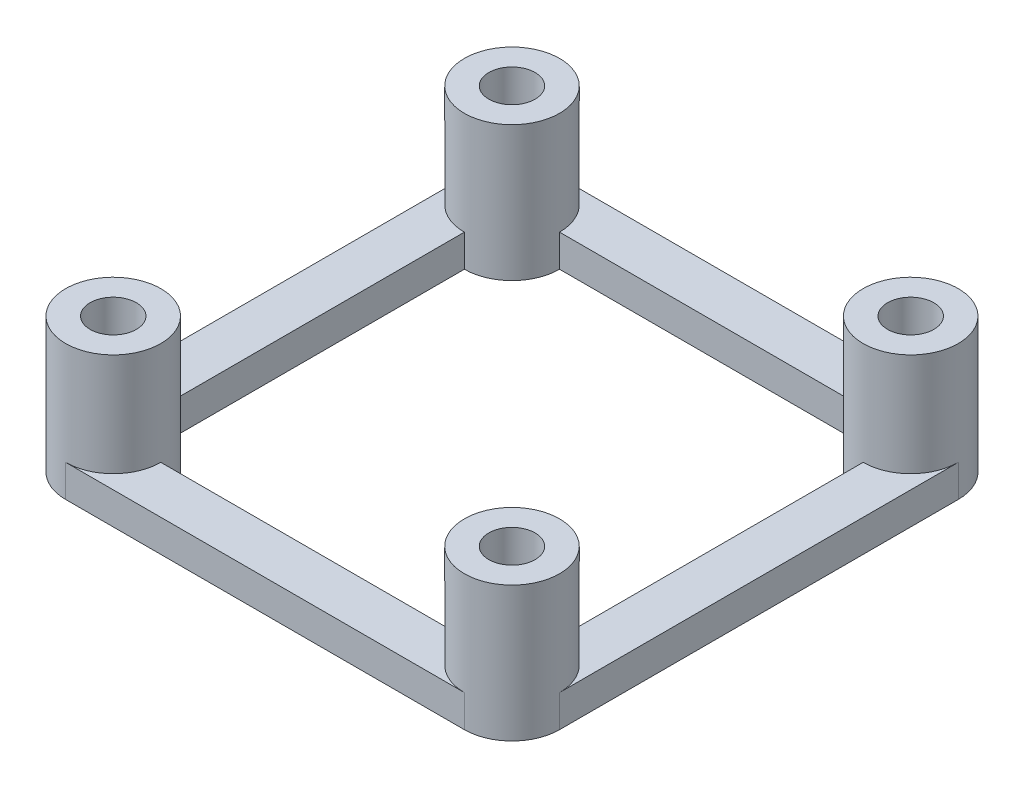
ISO-10303-21;
HEADER;
FILE_DESCRIPTION(('STEP AP214'),'2;1');
FILE_NAME('part.step','',(''),(''),'','','');
FILE_SCHEMA(('AUTOMOTIVE_DESIGN { 1 0 10303 214 1 1 1 1 }'));
ENDSEC;
DATA;
#1=APPLICATION_CONTEXT('core data for automotive mechanical design processes');
#2=APPLICATION_PROTOCOL_DEFINITION('international standard','automotive_design',2000,#1);
#3=PRODUCT_CONTEXT('',#1,'mechanical');
#4=PRODUCT('Part','Part','',(#3));
#5=PRODUCT_RELATED_PRODUCT_CATEGORY('part','',(#4));
#6=PRODUCT_DEFINITION_FORMATION('','',#4);
#7=PRODUCT_DEFINITION_CONTEXT('part definition',#1,'design');
#8=PRODUCT_DEFINITION('design','',#6,#7);
#9=PRODUCT_DEFINITION_SHAPE('','',#8);
#10=(LENGTH_UNIT() NAMED_UNIT(*) SI_UNIT(.MILLI.,.METRE.));
#11=(NAMED_UNIT(*) PLANE_ANGLE_UNIT() SI_UNIT($,.RADIAN.));
#12=(NAMED_UNIT(*) SI_UNIT($,.STERADIAN.) SOLID_ANGLE_UNIT());
#13=UNCERTAINTY_MEASURE_WITH_UNIT(LENGTH_MEASURE(1.E-05),#10,'distance_accuracy_value','');
#14=(GEOMETRIC_REPRESENTATION_CONTEXT(3) GLOBAL_UNCERTAINTY_ASSIGNED_CONTEXT((#13)) GLOBAL_UNIT_ASSIGNED_CONTEXT((#10,
#11,#12)) REPRESENTATION_CONTEXT('',''));
#15=CARTESIAN_POINT('',(0.,0.,0.));
#16=DIRECTION('',(0.,0.,1.));
#17=DIRECTION('',(1.,0.,0.));
#18=AXIS2_PLACEMENT_3D('',#15,#16,#17);
#19=CARTESIAN_POINT('',(-15.5,2.5,-15.5));
#20=DIRECTION('',(0.,1.,0.));
#21=DIRECTION('',(0.,0.,1.));
#22=AXIS2_PLACEMENT_3D('',#19,#20,#21);
#23=PLANE('',#22);
#24=DIRECTION('',(0.,0.,1.));
#25=VECTOR('',#24,1.);
#26=CARTESIAN_POINT('',(-19.2,2.5,-15.5));
#27=LINE('',#26,#25);
#28=CARTESIAN_POINT('',(-19.2,2.5,-15.5));
#29=VERTEX_POINT('',#28);
#30=CARTESIAN_POINT('',(-19.2,2.5,15.5));
#31=VERTEX_POINT('',#30);
#32=EDGE_CURVE('E180',#29,#31,#27,.T.);
#33=ORIENTED_EDGE('',*,*,#32,.T.);
#34=CARTESIAN_POINT('',(-15.5,2.5,15.5));
#35=DIRECTION('',(0.,1.,0.));
#36=DIRECTION('',(0.,0.,1.));
#37=AXIS2_PLACEMENT_3D('',#34,#35,#36);
#38=CIRCLE('',#37,3.7);
#39=CARTESIAN_POINT('',(-15.5,2.5,11.8));
#40=VERTEX_POINT('',#39);
#41=EDGE_CURVE('E163',#40,#31,#38,.T.);
#42=ORIENTED_EDGE('',*,*,#41,.F.);
#43=DIRECTION('',(0.,0.,1.));
#44=VECTOR('',#43,1.);
#45=CARTESIAN_POINT('',(-15.5,2.5,-11.8));
#46=LINE('',#45,#44);
#47=CARTESIAN_POINT('',(-15.5,2.5,-11.8));
#48=VERTEX_POINT('',#47);
#49=EDGE_CURVE('E222',#48,#40,#46,.T.);
#50=ORIENTED_EDGE('',*,*,#49,.F.);
#51=CARTESIAN_POINT('',(-15.5,2.5,-15.5));
#52=DIRECTION('',(0.,1.,0.));
#53=DIRECTION('',(0.,0.,1.));
#54=AXIS2_PLACEMENT_3D('',#51,#52,#53);
#55=CIRCLE('',#54,3.7);
#56=EDGE_CURVE('E44',#29,#48,#55,.T.);
#57=ORIENTED_EDGE('',*,*,#56,.F.);
#58=EDGE_LOOP('',(#33,#42,#50,#57));
#59=FACE_BOUND('',#58,.T.);
#60=ADVANCED_FACE('F35',(#59),#23,.T.);
#61=DIRECTION('',(1.,0.,0.));
#62=VECTOR('',#61,1.);
#63=CARTESIAN_POINT('',(-11.8,2.5,15.5));
#64=LINE('',#63,#62);
#65=CARTESIAN_POINT('',(-11.8,2.5,15.5));
#66=VERTEX_POINT('',#65);
#67=CARTESIAN_POINT('',(11.8,2.5,15.5));
#68=VERTEX_POINT('',#67);
#69=EDGE_CURVE('E159',#66,#68,#64,.T.);
#70=ORIENTED_EDGE('',*,*,#69,.F.);
#71=CARTESIAN_POINT('',(-15.5,2.5,19.2));
#72=VERTEX_POINT('',#71);
#73=EDGE_CURVE('E152',#72,#66,#38,.T.);
#74=ORIENTED_EDGE('',*,*,#73,.F.);
#75=DIRECTION('',(1.,0.,0.));
#76=VECTOR('',#75,1.);
#77=CARTESIAN_POINT('',(-15.5,2.5,19.2));
#78=LINE('',#77,#76);
#79=CARTESIAN_POINT('',(15.5,2.5,19.2));
#80=VERTEX_POINT('',#79);
#81=EDGE_CURVE('E156',#72,#80,#78,.T.);
#82=ORIENTED_EDGE('',*,*,#81,.T.);
#83=CARTESIAN_POINT('',(15.5,2.5,15.5));
#84=DIRECTION('',(0.,1.,0.));
#85=DIRECTION('',(0.,0.,1.));
#86=AXIS2_PLACEMENT_3D('',#83,#84,#85);
#87=CIRCLE('',#86,3.7);
#88=EDGE_CURVE('E258',#68,#80,#87,.T.);
#89=ORIENTED_EDGE('',*,*,#88,.F.);
#90=EDGE_LOOP('',(#70,#74,#82,#89));
#91=FACE_BOUND('',#90,.T.);
#92=ADVANCED_FACE('F154',(#91),#23,.T.);
#93=DIRECTION('',(0.,0.,-1.));
#94=VECTOR('',#93,1.);
#95=CARTESIAN_POINT('',(15.5,2.5,-11.8));
#96=LINE('',#95,#94);
#97=CARTESIAN_POINT('',(15.5,2.5,11.8));
#98=VERTEX_POINT('',#97);
#99=CARTESIAN_POINT('',(15.5,2.5,-11.8));
#100=VERTEX_POINT('',#99);
#101=EDGE_CURVE('E284',#98,#100,#96,.T.);
#102=ORIENTED_EDGE('',*,*,#101,.F.);
#103=CARTESIAN_POINT('',(19.2,2.5,15.5));
#104=VERTEX_POINT('',#103);
#105=EDGE_CURVE('E261',#104,#98,#87,.T.);
#106=ORIENTED_EDGE('',*,*,#105,.F.);
#107=DIRECTION('',(0.,0.,-1.));
#108=VECTOR('',#107,1.);
#109=CARTESIAN_POINT('',(19.2,2.5,-15.5));
#110=LINE('',#109,#108);
#111=CARTESIAN_POINT('',(19.2,2.5,-15.5));
#112=VERTEX_POINT('',#111);
#113=EDGE_CURVE('E179',#104,#112,#110,.T.);
#114=ORIENTED_EDGE('',*,*,#113,.T.);
#115=CARTESIAN_POINT('',(15.5,2.5,-15.5));
#116=DIRECTION('',(0.,1.,0.));
#117=DIRECTION('',(0.,0.,1.));
#118=AXIS2_PLACEMENT_3D('',#115,#116,#117);
#119=CIRCLE('',#118,3.7);
#120=EDGE_CURVE('E276',#100,#112,#119,.T.);
#121=ORIENTED_EDGE('',*,*,#120,.F.);
#122=EDGE_LOOP('',(#102,#106,#114,#121));
#123=FACE_BOUND('',#122,.T.);
#124=ADVANCED_FACE('F367',(#123),#23,.T.);
#125=DIRECTION('',(-1.,0.,0.));
#126=VECTOR('',#125,1.);
#127=CARTESIAN_POINT('',(-11.8,2.5,-15.5));
#128=LINE('',#127,#126);
#129=CARTESIAN_POINT('',(11.8,2.5,-15.5));
#130=VERTEX_POINT('',#129);
#131=CARTESIAN_POINT('',(-11.8,2.5,-15.5));
#132=VERTEX_POINT('',#131);
#133=EDGE_CURVE('E287',#130,#132,#128,.T.);
#134=ORIENTED_EDGE('',*,*,#133,.F.);
#135=CARTESIAN_POINT('',(15.5,2.5,-19.2));
#136=VERTEX_POINT('',#135);
#137=EDGE_CURVE('E52',#136,#130,#119,.T.);
#138=ORIENTED_EDGE('',*,*,#137,.F.);
#139=DIRECTION('',(-1.,0.,0.));
#140=VECTOR('',#139,1.);
#141=CARTESIAN_POINT('',(-15.5,2.5,-19.2));
#142=LINE('',#141,#140);
#143=CARTESIAN_POINT('',(-15.5,2.5,-19.2));
#144=VERTEX_POINT('',#143);
#145=EDGE_CURVE('E183',#136,#144,#142,.T.);
#146=ORIENTED_EDGE('',*,*,#145,.T.);
#147=EDGE_CURVE('E11',#132,#144,#55,.T.);
#148=ORIENTED_EDGE('',*,*,#147,.F.);
#149=EDGE_LOOP('',(#134,#138,#146,#148));
#150=FACE_BOUND('',#149,.T.);
#151=ADVANCED_FACE('F363',(#150),#23,.T.);
#152=CARTESIAN_POINT('',(-15.5,0.,-15.5));
#153=DIRECTION('',(0.,1.,0.));
#154=DIRECTION('',(0.,0.,1.));
#155=AXIS2_PLACEMENT_3D('',#152,#153,#154);
#156=PLANE('',#155);
#157=CARTESIAN_POINT('',(15.5,0.,15.5));
#158=DIRECTION('',(0.,1.,0.));
#159=DIRECTION('',(0.,0.,1.));
#160=AXIS2_PLACEMENT_3D('',#157,#158,#159);
#161=CIRCLE('',#160,1.79999999999999);
#162=CARTESIAN_POINT('',(15.5,0.,17.3));
#163=VERTEX_POINT('',#162);
#164=EDGE_CURVE('E323',#163,#163,#161,.T.);
#165=ORIENTED_EDGE('',*,*,#164,.T.);
#166=EDGE_LOOP('',(#165));
#167=FACE_BOUND('',#166,.T.);
#168=CARTESIAN_POINT('',(-15.5,0.,15.5));
#169=DIRECTION('',(0.,1.,0.));
#170=DIRECTION('',(0.,0.,1.));
#171=AXIS2_PLACEMENT_3D('',#168,#169,#170);
#172=CIRCLE('',#171,1.79999999999999);
#173=CARTESIAN_POINT('',(-15.5,0.,17.3));
#174=VERTEX_POINT('',#173);
#175=EDGE_CURVE('E326',#174,#174,#172,.T.);
#176=ORIENTED_EDGE('',*,*,#175,.T.);
#177=EDGE_LOOP('',(#176));
#178=FACE_BOUND('',#177,.T.);
#179=CARTESIAN_POINT('',(15.5,0.,-15.5));
#180=DIRECTION('',(0.,1.,0.));
#181=DIRECTION('',(0.,0.,1.));
#182=AXIS2_PLACEMENT_3D('',#179,#180,#181);
#183=CIRCLE('',#182,1.8);
#184=CARTESIAN_POINT('',(15.5,0.,-13.7));
#185=VERTEX_POINT('',#184);
#186=EDGE_CURVE('E328',#185,#185,#183,.T.);
#187=ORIENTED_EDGE('',*,*,#186,.T.);
#188=EDGE_LOOP('',(#187));
#189=FACE_BOUND('',#188,.T.);
#190=CARTESIAN_POINT('',(-15.5,0.,-15.5));
#191=DIRECTION('',(0.,1.,0.));
#192=DIRECTION('',(0.,0.,1.));
#193=AXIS2_PLACEMENT_3D('',#190,#191,#192);
#194=CIRCLE('',#193,1.8);
#195=CARTESIAN_POINT('',(-15.5,0.,-13.7));
#196=VERTEX_POINT('',#195);
#197=EDGE_CURVE('E189',#196,#196,#194,.T.);
#198=ORIENTED_EDGE('',*,*,#197,.T.);
#199=EDGE_LOOP('',(#198));
#200=FACE_BOUND('',#199,.T.);
#201=CARTESIAN_POINT('',(-15.5,0.,-15.5));
#202=DIRECTION('',(0.,1.,0.));
#203=DIRECTION('',(0.,0.,1.));
#204=AXIS2_PLACEMENT_3D('',#201,#202,#203);
#205=CIRCLE('',#204,3.7);
#206=CARTESIAN_POINT('',(-15.5,0.,-19.2));
#207=VERTEX_POINT('',#206);
#208=CARTESIAN_POINT('',(-19.2,0.,-15.5));
#209=VERTEX_POINT('',#208);
#210=EDGE_CURVE('E192',#207,#209,#205,.T.);
#211=ORIENTED_EDGE('',*,*,#210,.F.);
#212=DIRECTION('',(-1.,0.,0.));
#213=VECTOR('',#212,1.);
#214=CARTESIAN_POINT('',(-15.5,0.,-19.2));
#215=LINE('',#214,#213);
#216=CARTESIAN_POINT('',(15.5,0.,-19.2));
#217=VERTEX_POINT('',#216);
#218=EDGE_CURVE('E186',#217,#207,#215,.T.);
#219=ORIENTED_EDGE('',*,*,#218,.F.);
#220=CARTESIAN_POINT('',(15.5,0.,-15.5));
#221=DIRECTION('',(0.,1.,0.));
#222=DIRECTION('',(0.,0.,1.));
#223=AXIS2_PLACEMENT_3D('',#220,#221,#222);
#224=CIRCLE('',#223,3.7);
#225=CARTESIAN_POINT('',(19.2,0.,-15.5));
#226=VERTEX_POINT('',#225);
#227=EDGE_CURVE('E204',#226,#217,#224,.T.);
#228=ORIENTED_EDGE('',*,*,#227,.F.);
#229=DIRECTION('',(0.,0.,-1.));
#230=VECTOR('',#229,1.);
#231=CARTESIAN_POINT('',(19.2,0.,-15.5));
#232=LINE('',#231,#230);
#233=CARTESIAN_POINT('',(19.2,0.,15.5));
#234=VERTEX_POINT('',#233);
#235=EDGE_CURVE('E202',#234,#226,#232,.T.);
#236=ORIENTED_EDGE('',*,*,#235,.F.);
#237=CARTESIAN_POINT('',(15.5,0.,15.5));
#238=DIRECTION('',(0.,1.,0.));
#239=DIRECTION('',(0.,0.,1.));
#240=AXIS2_PLACEMENT_3D('',#237,#238,#239);
#241=CIRCLE('',#240,3.7);
#242=CARTESIAN_POINT('',(15.5,0.,19.2));
#243=VERTEX_POINT('',#242);
#244=EDGE_CURVE('E200',#243,#234,#241,.T.);
#245=ORIENTED_EDGE('',*,*,#244,.F.);
#246=DIRECTION('',(1.,0.,0.));
#247=VECTOR('',#246,1.);
#248=CARTESIAN_POINT('',(-15.5,0.,19.2));
#249=LINE('',#248,#247);
#250=CARTESIAN_POINT('',(-15.5,0.,19.2));
#251=VERTEX_POINT('',#250);
#252=EDGE_CURVE('E198',#251,#243,#249,.T.);
#253=ORIENTED_EDGE('',*,*,#252,.F.);
#254=CARTESIAN_POINT('',(-15.5,0.,15.5));
#255=DIRECTION('',(0.,1.,0.));
#256=DIRECTION('',(0.,0.,1.));
#257=AXIS2_PLACEMENT_3D('',#254,#255,#256);
#258=CIRCLE('',#257,3.7);
#259=CARTESIAN_POINT('',(-19.2,0.,15.5));
#260=VERTEX_POINT('',#259);
#261=EDGE_CURVE('E171',#260,#251,#258,.T.);
#262=ORIENTED_EDGE('',*,*,#261,.F.);
#263=DIRECTION('',(0.,0.,1.));
#264=VECTOR('',#263,1.);
#265=CARTESIAN_POINT('',(-19.2,0.,-15.5));
#266=LINE('',#265,#264);
#267=EDGE_CURVE('E195',#209,#260,#266,.T.);
#268=ORIENTED_EDGE('',*,*,#267,.F.);
#269=EDGE_LOOP('',(#211,#219,#228,#236,#245,#253,#262,#268));
#270=FACE_BOUND('',#269,.T.);
#271=CARTESIAN_POINT('',(-15.5,0.,-15.5));
#272=DIRECTION('',(0.,-1.,0.));
#273=DIRECTION('',(0.,0.,1.));
#274=AXIS2_PLACEMENT_3D('',#271,#272,#273);
#275=CIRCLE('',#274,3.7);
#276=CARTESIAN_POINT('',(-11.8,0.,-15.5));
#277=VERTEX_POINT('',#276);
#278=CARTESIAN_POINT('',(-15.5,0.,-11.8));
#279=VERTEX_POINT('',#278);
#280=EDGE_CURVE('E60',#277,#279,#275,.T.);
#281=ORIENTED_EDGE('',*,*,#280,.T.);
#282=DIRECTION('',(0.,0.,1.));
#283=VECTOR('',#282,1.);
#284=CARTESIAN_POINT('',(-15.5,0.,-11.8));
#285=LINE('',#284,#283);
#286=CARTESIAN_POINT('',(-15.5,0.,11.8));
#287=VERTEX_POINT('',#286);
#288=EDGE_CURVE('E289',#279,#287,#285,.T.);
#289=ORIENTED_EDGE('',*,*,#288,.T.);
#290=CARTESIAN_POINT('',(-15.5,0.,15.5));
#291=DIRECTION('',(0.,-1.,0.));
#292=DIRECTION('',(0.,0.,1.));
#293=AXIS2_PLACEMENT_3D('',#290,#291,#292);
#294=CIRCLE('',#293,3.7);
#295=CARTESIAN_POINT('',(-11.8,0.,15.5));
#296=VERTEX_POINT('',#295);
#297=EDGE_CURVE('E292',#287,#296,#294,.T.);
#298=ORIENTED_EDGE('',*,*,#297,.T.);
#299=DIRECTION('',(1.,0.,0.));
#300=VECTOR('',#299,1.);
#301=CARTESIAN_POINT('',(-11.8,0.,15.5));
#302=LINE('',#301,#300);
#303=CARTESIAN_POINT('',(11.8,0.,15.5));
#304=VERTEX_POINT('',#303);
#305=EDGE_CURVE('E295',#296,#304,#302,.T.);
#306=ORIENTED_EDGE('',*,*,#305,.T.);
#307=CARTESIAN_POINT('',(15.5,0.,15.5));
#308=DIRECTION('',(0.,-1.,0.));
#309=DIRECTION('',(0.,0.,1.));
#310=AXIS2_PLACEMENT_3D('',#307,#308,#309);
#311=CIRCLE('',#310,3.7);
#312=CARTESIAN_POINT('',(15.5,0.,11.8));
#313=VERTEX_POINT('',#312);
#314=EDGE_CURVE('E298',#304,#313,#311,.T.);
#315=ORIENTED_EDGE('',*,*,#314,.T.);
#316=DIRECTION('',(0.,0.,-1.));
#317=VECTOR('',#316,1.);
#318=CARTESIAN_POINT('',(15.5,0.,-11.8));
#319=LINE('',#318,#317);
#320=CARTESIAN_POINT('',(15.5,0.,-11.8));
#321=VERTEX_POINT('',#320);
#322=EDGE_CURVE('E301',#313,#321,#319,.T.);
#323=ORIENTED_EDGE('',*,*,#322,.T.);
#324=CARTESIAN_POINT('',(15.5,0.,-15.5));
#325=DIRECTION('',(0.,-1.,0.));
#326=DIRECTION('',(0.,0.,1.));
#327=AXIS2_PLACEMENT_3D('',#324,#325,#326);
#328=CIRCLE('',#327,3.7);
#329=CARTESIAN_POINT('',(11.8,0.,-15.5));
#330=VERTEX_POINT('',#329);
#331=EDGE_CURVE('E304',#321,#330,#328,.T.);
#332=ORIENTED_EDGE('',*,*,#331,.T.);
#333=DIRECTION('',(-1.,0.,0.));
#334=VECTOR('',#333,1.);
#335=CARTESIAN_POINT('',(-11.8,0.,-15.5));
#336=LINE('',#335,#334);
#337=EDGE_CURVE('E307',#330,#277,#336,.T.);
#338=ORIENTED_EDGE('',*,*,#337,.T.);
#339=EDGE_LOOP('',(#281,#289,#298,#306,#315,#323,#332,#338));
#340=FACE_BOUND('',#339,.T.);
#341=ADVANCED_FACE('F248',(#167,#178,#189,#200,#270,#340),#156,.F.);
#342=CARTESIAN_POINT('',(-15.5,2.5,-15.5));
#343=DIRECTION('',(0.,-1.,0.));
#344=DIRECTION('',(0.,0.,-1.));
#345=AXIS2_PLACEMENT_3D('',#342,#343,#344);
#346=CYLINDRICAL_SURFACE('',#345,3.7);
#347=ORIENTED_EDGE('',*,*,#210,.T.);
#348=DIRECTION('',(0.,-1.,0.));
#349=VECTOR('',#348,1.);
#350=CARTESIAN_POINT('',(-19.2,2.5,-15.5));
#351=LINE('',#350,#349);
#352=EDGE_CURVE('E219',#29,#209,#351,.T.);
#353=ORIENTED_EDGE('',*,*,#352,.F.);
#354=ORIENTED_EDGE('',*,*,#56,.T.);
#355=DIRECTION('',(0.,-1.,0.));
#356=VECTOR('',#355,1.);
#357=CARTESIAN_POINT('',(-15.5,2.5,-11.8));
#358=LINE('',#357,#356);
#359=EDGE_CURVE('E322',#48,#279,#358,.T.);
#360=ORIENTED_EDGE('',*,*,#359,.T.);
#361=ORIENTED_EDGE('',*,*,#280,.F.);
#362=DIRECTION('',(0.,-1.,0.));
#363=VECTOR('',#362,1.);
#364=CARTESIAN_POINT('',(-11.8,2.5,-15.5));
#365=LINE('',#364,#363);
#366=EDGE_CURVE('E313',#132,#277,#365,.T.);
#367=ORIENTED_EDGE('',*,*,#366,.F.);
#368=ORIENTED_EDGE('',*,*,#147,.T.);
#369=DIRECTION('',(0.,-1.,0.));
#370=VECTOR('',#369,1.);
#371=CARTESIAN_POINT('',(-15.5,2.5,-19.2));
#372=LINE('',#371,#370);
#373=EDGE_CURVE('E211',#144,#207,#372,.T.);
#374=ORIENTED_EDGE('',*,*,#373,.T.);
#375=EDGE_LOOP('',(#347,#353,#354,#360,#361,#367,#368,#374));
#376=FACE_BOUND('',#375,.T.);
#377=CARTESIAN_POINT('',(-15.5,10.5,-15.5));
#378=DIRECTION('',(0.,1.,0.));
#379=DIRECTION('',(0.,0.,1.));
#380=AXIS2_PLACEMENT_3D('',#377,#378,#379);
#381=CIRCLE('',#380,3.7);
#382=CARTESIAN_POINT('',(-15.5,10.5,-11.8));
#383=VERTEX_POINT('',#382);
#384=EDGE_CURVE('E280',#383,#383,#381,.T.);
#385=ORIENTED_EDGE('',*,*,#384,.F.);
#386=EDGE_LOOP('',(#385));
#387=FACE_BOUND('',#386,.T.);
#388=ADVANCED_FACE('F37',(#376,#387),#346,.T.);
#389=CARTESIAN_POINT('',(-19.2,2.5,-15.5));
#390=DIRECTION('',(1.,0.,0.));
#391=DIRECTION('',(0.,0.,-1.));
#392=AXIS2_PLACEMENT_3D('',#389,#390,#391);
#393=PLANE('',#392);
#394=ORIENTED_EDGE('',*,*,#267,.T.);
#395=DIRECTION('',(0.,-1.,0.));
#396=VECTOR('',#395,1.);
#397=CARTESIAN_POINT('',(-19.2,2.5,15.5));
#398=LINE('',#397,#396);
#399=EDGE_CURVE('E174',#31,#260,#398,.T.);
#400=ORIENTED_EDGE('',*,*,#399,.F.);
#401=ORIENTED_EDGE('',*,*,#32,.F.);
#402=ORIENTED_EDGE('',*,*,#352,.T.);
#403=EDGE_LOOP('',(#394,#400,#401,#402));
#404=FACE_BOUND('',#403,.T.);
#405=ADVANCED_FACE('F240',(#404),#393,.F.);
#406=CARTESIAN_POINT('',(-15.5,2.5,15.5));
#407=DIRECTION('',(0.,-1.,0.));
#408=DIRECTION('',(0.,0.,-1.));
#409=AXIS2_PLACEMENT_3D('',#406,#407,#408);
#410=CYLINDRICAL_SURFACE('',#409,3.7);
#411=ORIENTED_EDGE('',*,*,#261,.T.);
#412=DIRECTION('',(0.,-1.,0.));
#413=VECTOR('',#412,1.);
#414=CARTESIAN_POINT('',(-15.5,2.5,19.2));
#415=LINE('',#414,#413);
#416=EDGE_CURVE('E166',#72,#251,#415,.T.);
#417=ORIENTED_EDGE('',*,*,#416,.F.);
#418=ORIENTED_EDGE('',*,*,#73,.T.);
#419=DIRECTION('',(0.,-1.,0.));
#420=VECTOR('',#419,1.);
#421=CARTESIAN_POINT('',(-11.8,2.5,15.5));
#422=LINE('',#421,#420);
#423=EDGE_CURVE('E318',#66,#296,#422,.T.);
#424=ORIENTED_EDGE('',*,*,#423,.T.);
#425=ORIENTED_EDGE('',*,*,#297,.F.);
#426=DIRECTION('',(0.,-1.,0.));
#427=VECTOR('',#426,1.);
#428=CARTESIAN_POINT('',(-15.5,2.5,11.8));
#429=LINE('',#428,#427);
#430=EDGE_CURVE('E320',#40,#287,#429,.T.);
#431=ORIENTED_EDGE('',*,*,#430,.F.);
#432=ORIENTED_EDGE('',*,*,#41,.T.);
#433=ORIENTED_EDGE('',*,*,#399,.T.);
#434=EDGE_LOOP('',(#411,#417,#418,#424,#425,#431,#432,#433));
#435=FACE_BOUND('',#434,.T.);
#436=CARTESIAN_POINT('',(-15.5,10.5,15.5));
#437=DIRECTION('',(0.,1.,0.));
#438=DIRECTION('',(0.,0.,1.));
#439=AXIS2_PLACEMENT_3D('',#436,#437,#438);
#440=CIRCLE('',#439,3.7);
#441=CARTESIAN_POINT('',(-15.5,10.5,19.2));
#442=VERTEX_POINT('',#441);
#443=EDGE_CURVE('E162',#442,#442,#440,.T.);
#444=ORIENTED_EDGE('',*,*,#443,.F.);
#445=EDGE_LOOP('',(#444));
#446=FACE_BOUND('',#445,.T.);
#447=ADVANCED_FACE('F167',(#435,#446),#410,.T.);
#448=CARTESIAN_POINT('',(-15.5,2.5,19.2));
#449=DIRECTION('',(0.,0.,-1.));
#450=DIRECTION('',(-1.,0.,0.));
#451=AXIS2_PLACEMENT_3D('',#448,#449,#450);
#452=PLANE('',#451);
#453=ORIENTED_EDGE('',*,*,#252,.T.);
#454=DIRECTION('',(0.,-1.,0.));
#455=VECTOR('',#454,1.);
#456=CARTESIAN_POINT('',(15.5,2.5,19.2));
#457=LINE('',#456,#455);
#458=EDGE_CURVE('E175',#80,#243,#457,.T.);
#459=ORIENTED_EDGE('',*,*,#458,.F.);
#460=ORIENTED_EDGE('',*,*,#81,.F.);
#461=ORIENTED_EDGE('',*,*,#416,.T.);
#462=EDGE_LOOP('',(#453,#459,#460,#461));
#463=FACE_BOUND('',#462,.T.);
#464=ADVANCED_FACE('F177',(#463),#452,.F.);
#465=CARTESIAN_POINT('',(15.5,2.5,15.5));
#466=DIRECTION('',(0.,-1.,0.));
#467=DIRECTION('',(0.,0.,-1.));
#468=AXIS2_PLACEMENT_3D('',#465,#466,#467);
#469=CYLINDRICAL_SURFACE('',#468,3.7);
#470=ORIENTED_EDGE('',*,*,#244,.T.);
#471=DIRECTION('',(0.,-1.,0.));
#472=VECTOR('',#471,1.);
#473=CARTESIAN_POINT('',(19.2,2.5,15.5));
#474=LINE('',#473,#472);
#475=EDGE_CURVE('E214',#104,#234,#474,.T.);
#476=ORIENTED_EDGE('',*,*,#475,.F.);
#477=ORIENTED_EDGE('',*,*,#105,.T.);
#478=DIRECTION('',(0.,-1.,0.));
#479=VECTOR('',#478,1.);
#480=CARTESIAN_POINT('',(15.5,2.5,11.8));
#481=LINE('',#480,#479);
#482=EDGE_CURVE('E315',#98,#313,#481,.T.);
#483=ORIENTED_EDGE('',*,*,#482,.T.);
#484=ORIENTED_EDGE('',*,*,#314,.F.);
#485=DIRECTION('',(0.,-1.,0.));
#486=VECTOR('',#485,1.);
#487=CARTESIAN_POINT('',(11.8,2.5,15.5));
#488=LINE('',#487,#486);
#489=EDGE_CURVE('E260',#68,#304,#488,.T.);
#490=ORIENTED_EDGE('',*,*,#489,.F.);
#491=ORIENTED_EDGE('',*,*,#88,.T.);
#492=ORIENTED_EDGE('',*,*,#458,.T.);
#493=EDGE_LOOP('',(#470,#476,#477,#483,#484,#490,#491,#492));
#494=FACE_BOUND('',#493,.T.);
#495=CARTESIAN_POINT('',(15.5,10.5,15.5));
#496=DIRECTION('',(0.,1.,0.));
#497=DIRECTION('',(0.,0.,1.));
#498=AXIS2_PLACEMENT_3D('',#495,#496,#497);
#499=CIRCLE('',#498,3.7);
#500=CARTESIAN_POINT('',(15.5,10.5,19.2));
#501=VERTEX_POINT('',#500);
#502=EDGE_CURVE('E264',#501,#501,#499,.T.);
#503=ORIENTED_EDGE('',*,*,#502,.F.);
#504=EDGE_LOOP('',(#503));
#505=FACE_BOUND('',#504,.T.);
#506=ADVANCED_FACE('F254',(#494,#505),#469,.T.);
#507=CARTESIAN_POINT('',(19.2,2.5,-15.5));
#508=DIRECTION('',(-1.,0.,0.));
#509=DIRECTION('',(0.,0.,1.));
#510=AXIS2_PLACEMENT_3D('',#507,#508,#509);
#511=PLANE('',#510);
#512=ORIENTED_EDGE('',*,*,#235,.T.);
#513=DIRECTION('',(0.,-1.,0.));
#514=VECTOR('',#513,1.);
#515=CARTESIAN_POINT('',(19.2,2.5,-15.5));
#516=LINE('',#515,#514);
#517=EDGE_CURVE('E210',#112,#226,#516,.T.);
#518=ORIENTED_EDGE('',*,*,#517,.F.);
#519=ORIENTED_EDGE('',*,*,#113,.F.);
#520=ORIENTED_EDGE('',*,*,#475,.T.);
#521=EDGE_LOOP('',(#512,#518,#519,#520));
#522=FACE_BOUND('',#521,.T.);
#523=ADVANCED_FACE('F401',(#522),#511,.F.);
#524=CARTESIAN_POINT('',(15.5,2.5,-15.5));
#525=DIRECTION('',(0.,-1.,0.));
#526=DIRECTION('',(0.,0.,-1.));
#527=AXIS2_PLACEMENT_3D('',#524,#525,#526);
#528=CYLINDRICAL_SURFACE('',#527,3.7);
#529=ORIENTED_EDGE('',*,*,#227,.T.);
#530=DIRECTION('',(0.,-1.,0.));
#531=VECTOR('',#530,1.);
#532=CARTESIAN_POINT('',(15.5,2.5,-19.2));
#533=LINE('',#532,#531);
#534=EDGE_CURVE('E207',#136,#217,#533,.T.);
#535=ORIENTED_EDGE('',*,*,#534,.F.);
#536=ORIENTED_EDGE('',*,*,#137,.T.);
#537=DIRECTION('',(0.,-1.,0.));
#538=VECTOR('',#537,1.);
#539=CARTESIAN_POINT('',(11.8,2.5,-15.5));
#540=LINE('',#539,#538);
#541=EDGE_CURVE('E310',#130,#330,#540,.T.);
#542=ORIENTED_EDGE('',*,*,#541,.T.);
#543=ORIENTED_EDGE('',*,*,#331,.F.);
#544=DIRECTION('',(0.,-1.,0.));
#545=VECTOR('',#544,1.);
#546=CARTESIAN_POINT('',(15.5,2.5,-11.8));
#547=LINE('',#546,#545);
#548=EDGE_CURVE('E312',#100,#321,#547,.T.);
#549=ORIENTED_EDGE('',*,*,#548,.F.);
#550=ORIENTED_EDGE('',*,*,#120,.T.);
#551=ORIENTED_EDGE('',*,*,#517,.T.);
#552=EDGE_LOOP('',(#529,#535,#536,#542,#543,#549,#550,#551));
#553=FACE_BOUND('',#552,.T.);
#554=CARTESIAN_POINT('',(15.5,10.5,-15.5));
#555=DIRECTION('',(0.,1.,0.));
#556=DIRECTION('',(0.,0.,1.));
#557=AXIS2_PLACEMENT_3D('',#554,#555,#556);
#558=CIRCLE('',#557,3.7);
#559=CARTESIAN_POINT('',(15.5,10.5,-11.8));
#560=VERTEX_POINT('',#559);
#561=EDGE_CURVE('E272',#560,#560,#558,.T.);
#562=ORIENTED_EDGE('',*,*,#561,.F.);
#563=EDGE_LOOP('',(#562));
#564=FACE_BOUND('',#563,.T.);
#565=ADVANCED_FACE('F393',(#553,#564),#528,.T.);
#566=CARTESIAN_POINT('',(-15.5,2.5,-19.2));
#567=DIRECTION('',(0.,0.,1.));
#568=DIRECTION('',(1.,0.,0.));
#569=AXIS2_PLACEMENT_3D('',#566,#567,#568);
#570=PLANE('',#569);
#571=ORIENTED_EDGE('',*,*,#218,.T.);
#572=ORIENTED_EDGE('',*,*,#373,.F.);
#573=ORIENTED_EDGE('',*,*,#145,.F.);
#574=ORIENTED_EDGE('',*,*,#534,.T.);
#575=EDGE_LOOP('',(#571,#572,#573,#574));
#576=FACE_BOUND('',#575,.T.);
#577=ADVANCED_FACE('F340',(#576),#570,.F.);
#578=CARTESIAN_POINT('',(-15.5,2.5,-15.5));
#579=DIRECTION('',(0.,-1.,0.));
#580=DIRECTION('',(0.,0.,-1.));
#581=AXIS2_PLACEMENT_3D('',#578,#579,#580);
#582=CYLINDRICAL_SURFACE('',#581,1.8);
#583=ORIENTED_EDGE('',*,*,#197,.F.);
#584=EDGE_LOOP('',(#583));
#585=FACE_BOUND('',#584,.T.);
#586=CARTESIAN_POINT('',(-15.5,10.5,-15.5));
#587=DIRECTION('',(0.,1.,0.));
#588=DIRECTION('',(0.,0.,1.));
#589=AXIS2_PLACEMENT_3D('',#586,#587,#588);
#590=CIRCLE('',#589,1.8);
#591=CARTESIAN_POINT('',(-15.5,10.5,-13.7));
#592=VERTEX_POINT('',#591);
#593=EDGE_CURVE('E275',#592,#592,#590,.T.);
#594=ORIENTED_EDGE('',*,*,#593,.T.);
#595=EDGE_LOOP('',(#594));
#596=FACE_BOUND('',#595,.T.);
#597=ADVANCED_FACE('F336',(#585,#596),#582,.F.);
#598=CARTESIAN_POINT('',(15.5,2.5,-15.5));
#599=DIRECTION('',(0.,-1.,0.));
#600=DIRECTION('',(0.,0.,-1.));
#601=AXIS2_PLACEMENT_3D('',#598,#599,#600);
#602=CYLINDRICAL_SURFACE('',#601,1.8);
#603=ORIENTED_EDGE('',*,*,#186,.F.);
#604=EDGE_LOOP('',(#603));
#605=FACE_BOUND('',#604,.T.);
#606=CARTESIAN_POINT('',(15.5,10.5,-15.5));
#607=DIRECTION('',(0.,1.,0.));
#608=DIRECTION('',(0.,0.,1.));
#609=AXIS2_PLACEMENT_3D('',#606,#607,#608);
#610=CIRCLE('',#609,1.8);
#611=CARTESIAN_POINT('',(15.5,10.5,-13.7));
#612=VERTEX_POINT('',#611);
#613=EDGE_CURVE('E269',#612,#612,#610,.T.);
#614=ORIENTED_EDGE('',*,*,#613,.T.);
#615=EDGE_LOOP('',(#614));
#616=FACE_BOUND('',#615,.T.);
#617=ADVANCED_FACE('F339',(#605,#616),#602,.F.);
#618=CARTESIAN_POINT('',(-15.5,2.5,15.5));
#619=DIRECTION('',(0.,-1.,0.));
#620=DIRECTION('',(0.,0.,-1.));
#621=AXIS2_PLACEMENT_3D('',#618,#619,#620);
#622=CYLINDRICAL_SURFACE('',#621,1.79999999999999);
#623=ORIENTED_EDGE('',*,*,#175,.F.);
#624=EDGE_LOOP('',(#623));
#625=FACE_BOUND('',#624,.T.);
#626=CARTESIAN_POINT('',(-15.5,10.5,15.5));
#627=DIRECTION('',(0.,1.,0.));
#628=DIRECTION('',(0.,0.,1.));
#629=AXIS2_PLACEMENT_3D('',#626,#627,#628);
#630=CIRCLE('',#629,1.79999999999999);
#631=CARTESIAN_POINT('',(-15.5,10.5,17.3));
#632=VERTEX_POINT('',#631);
#633=EDGE_CURVE('E412',#632,#632,#630,.T.);
#634=ORIENTED_EDGE('',*,*,#633,.T.);
#635=EDGE_LOOP('',(#634));
#636=FACE_BOUND('',#635,.T.);
#637=ADVANCED_FACE('F450',(#625,#636),#622,.F.);
#638=CARTESIAN_POINT('',(15.5,2.5,15.5));
#639=DIRECTION('',(0.,-1.,0.));
#640=DIRECTION('',(0.,0.,-1.));
#641=AXIS2_PLACEMENT_3D('',#638,#639,#640);
#642=CYLINDRICAL_SURFACE('',#641,1.79999999999999);
#643=ORIENTED_EDGE('',*,*,#164,.F.);
#644=EDGE_LOOP('',(#643));
#645=FACE_BOUND('',#644,.T.);
#646=CARTESIAN_POINT('',(15.5,10.5,15.5));
#647=DIRECTION('',(0.,1.,0.));
#648=DIRECTION('',(0.,0.,1.));
#649=AXIS2_PLACEMENT_3D('',#646,#647,#648);
#650=CIRCLE('',#649,1.79999999999999);
#651=CARTESIAN_POINT('',(15.5,10.5,17.3));
#652=VERTEX_POINT('',#651);
#653=EDGE_CURVE('E262',#652,#652,#650,.T.);
#654=ORIENTED_EDGE('',*,*,#653,.T.);
#655=EDGE_LOOP('',(#654));
#656=FACE_BOUND('',#655,.T.);
#657=ADVANCED_FACE('F458',(#645,#656),#642,.F.);
#658=CARTESIAN_POINT('',(-15.5,2.5,-11.8));
#659=DIRECTION('',(1.,0.,0.));
#660=DIRECTION('',(0.,0.,-1.));
#661=AXIS2_PLACEMENT_3D('',#658,#659,#660);
#662=PLANE('',#661);
#663=ORIENTED_EDGE('',*,*,#288,.F.);
#664=ORIENTED_EDGE('',*,*,#359,.F.);
#665=ORIENTED_EDGE('',*,*,#49,.T.);
#666=ORIENTED_EDGE('',*,*,#430,.T.);
#667=EDGE_LOOP('',(#663,#664,#665,#666));
#668=FACE_BOUND('',#667,.T.);
#669=ADVANCED_FACE('F409',(#668),#662,.T.);
#670=CARTESIAN_POINT('',(-11.8,2.5,15.5));
#671=DIRECTION('',(0.,0.,-1.));
#672=DIRECTION('',(-1.,0.,0.));
#673=AXIS2_PLACEMENT_3D('',#670,#671,#672);
#674=PLANE('',#673);
#675=ORIENTED_EDGE('',*,*,#305,.F.);
#676=ORIENTED_EDGE('',*,*,#423,.F.);
#677=ORIENTED_EDGE('',*,*,#69,.T.);
#678=ORIENTED_EDGE('',*,*,#489,.T.);
#679=EDGE_LOOP('',(#675,#676,#677,#678));
#680=FACE_BOUND('',#679,.T.);
#681=ADVANCED_FACE('F405',(#680),#674,.T.);
#682=CARTESIAN_POINT('',(15.5,2.5,-11.8));
#683=DIRECTION('',(-1.,0.,0.));
#684=DIRECTION('',(0.,0.,1.));
#685=AXIS2_PLACEMENT_3D('',#682,#683,#684);
#686=PLANE('',#685);
#687=ORIENTED_EDGE('',*,*,#322,.F.);
#688=ORIENTED_EDGE('',*,*,#482,.F.);
#689=ORIENTED_EDGE('',*,*,#101,.T.);
#690=ORIENTED_EDGE('',*,*,#548,.T.);
#691=EDGE_LOOP('',(#687,#688,#689,#690));
#692=FACE_BOUND('',#691,.T.);
#693=ADVANCED_FACE('F357',(#692),#686,.T.);
#694=CARTESIAN_POINT('',(-11.8,2.5,-15.5));
#695=DIRECTION('',(0.,0.,1.));
#696=DIRECTION('',(1.,0.,0.));
#697=AXIS2_PLACEMENT_3D('',#694,#695,#696);
#698=PLANE('',#697);
#699=ORIENTED_EDGE('',*,*,#337,.F.);
#700=ORIENTED_EDGE('',*,*,#541,.F.);
#701=ORIENTED_EDGE('',*,*,#133,.T.);
#702=ORIENTED_EDGE('',*,*,#366,.T.);
#703=EDGE_LOOP('',(#699,#700,#701,#702));
#704=FACE_BOUND('',#703,.T.);
#705=ADVANCED_FACE('F347',(#704),#698,.T.);
#706=CARTESIAN_POINT('',(-15.5,10.5,-15.5));
#707=DIRECTION('',(0.,1.,0.));
#708=DIRECTION('',(0.,0.,1.));
#709=AXIS2_PLACEMENT_3D('',#706,#707,#708);
#710=PLANE('',#709);
#711=ORIENTED_EDGE('',*,*,#384,.T.);
#712=EDGE_LOOP('',(#711));
#713=FACE_BOUND('',#712,.T.);
#714=ORIENTED_EDGE('',*,*,#593,.F.);
#715=EDGE_LOOP('',(#714));
#716=FACE_BOUND('',#715,.T.);
#717=ADVANCED_FACE('F344',(#713,#716),#710,.T.);
#718=CARTESIAN_POINT('',(15.5,10.5,-15.5));
#719=DIRECTION('',(0.,1.,0.));
#720=DIRECTION('',(0.,0.,1.));
#721=AXIS2_PLACEMENT_3D('',#718,#719,#720);
#722=PLANE('',#721);
#723=ORIENTED_EDGE('',*,*,#561,.T.);
#724=EDGE_LOOP('',(#723));
#725=FACE_BOUND('',#724,.T.);
#726=ORIENTED_EDGE('',*,*,#613,.F.);
#727=EDGE_LOOP('',(#726));
#728=FACE_BOUND('',#727,.T.);
#729=ADVANCED_FACE('F346',(#725,#728),#722,.T.);
#730=CARTESIAN_POINT('',(15.5,10.5,15.5));
#731=DIRECTION('',(0.,1.,0.));
#732=DIRECTION('',(0.,0.,1.));
#733=AXIS2_PLACEMENT_3D('',#730,#731,#732);
#734=PLANE('',#733);
#735=ORIENTED_EDGE('',*,*,#502,.T.);
#736=EDGE_LOOP('',(#735));
#737=FACE_BOUND('',#736,.T.);
#738=ORIENTED_EDGE('',*,*,#653,.F.);
#739=EDGE_LOOP('',(#738));
#740=FACE_BOUND('',#739,.T.);
#741=ADVANCED_FACE('F354',(#737,#740),#734,.T.);
#742=CARTESIAN_POINT('',(-15.5,10.5,15.5));
#743=DIRECTION('',(0.,1.,0.));
#744=DIRECTION('',(0.,0.,1.));
#745=AXIS2_PLACEMENT_3D('',#742,#743,#744);
#746=PLANE('',#745);
#747=ORIENTED_EDGE('',*,*,#443,.T.);
#748=EDGE_LOOP('',(#747));
#749=FACE_BOUND('',#748,.T.);
#750=ORIENTED_EDGE('',*,*,#633,.F.);
#751=EDGE_LOOP('',(#750));
#752=FACE_BOUND('',#751,.T.);
#753=ADVANCED_FACE('F419',(#749,#752),#746,.T.);
#754=CLOSED_SHELL('',(#60,#92,#124,#151,#341,#388,#405,#447,#464,#506,#523,#565,#577,#597,#617,
#637,#657,#669,#681,#693,#705,#717,#729,#741,#753));
#755=MANIFOLD_SOLID_BREP('B2',#754);
#756=ADVANCED_BREP_SHAPE_REPRESENTATION('',(#18,#755),#14);
#757=SHAPE_DEFINITION_REPRESENTATION(#9,#756);
ENDSEC;
END-ISO-10303-21;
